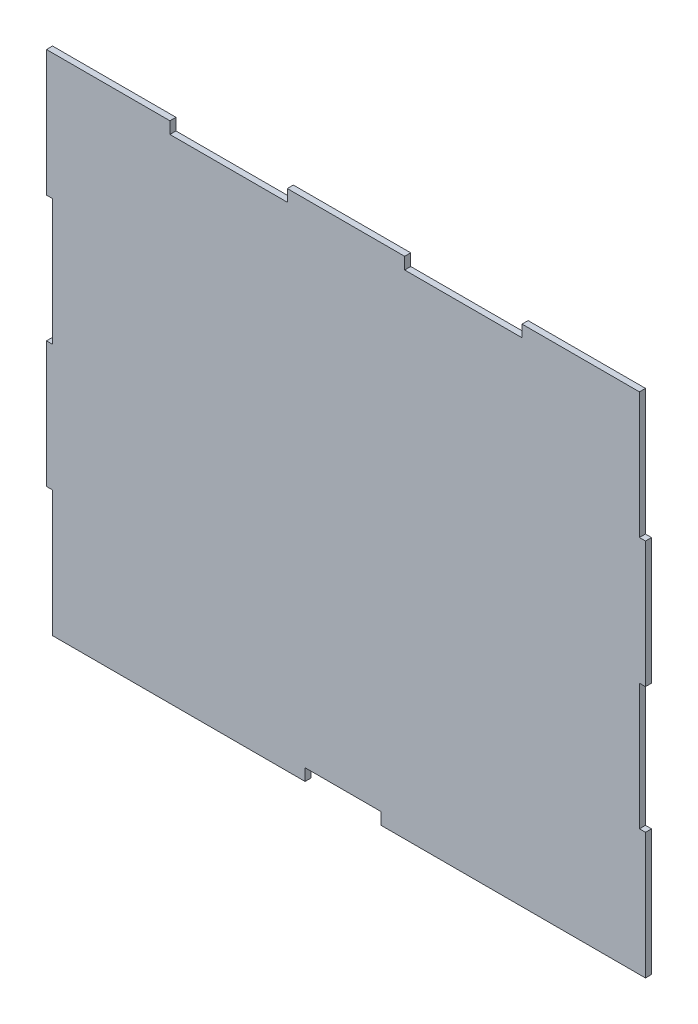
ISO-10303-21;
HEADER;
FILE_DESCRIPTION(('STEP AP214'),'2;1');
FILE_NAME('part.step','',(''),(''),'','','');
FILE_SCHEMA(('AUTOMOTIVE_DESIGN { 1 0 10303 214 1 1 1 1 }'));
ENDSEC;
DATA;
#1=APPLICATION_CONTEXT('core data for automotive mechanical design processes');
#2=APPLICATION_PROTOCOL_DEFINITION('international standard','automotive_design',2000,#1);
#3=PRODUCT_CONTEXT('',#1,'mechanical');
#4=PRODUCT('Part','Part','',(#3));
#5=PRODUCT_RELATED_PRODUCT_CATEGORY('part','',(#4));
#6=PRODUCT_DEFINITION_FORMATION('','',#4);
#7=PRODUCT_DEFINITION_CONTEXT('part definition',#1,'design');
#8=PRODUCT_DEFINITION('design','',#6,#7);
#9=PRODUCT_DEFINITION_SHAPE('','',#8);
#10=(LENGTH_UNIT() NAMED_UNIT(*) SI_UNIT(.MILLI.,.METRE.));
#11=(NAMED_UNIT(*) PLANE_ANGLE_UNIT() SI_UNIT($,.RADIAN.));
#12=(NAMED_UNIT(*) SI_UNIT($,.STERADIAN.) SOLID_ANGLE_UNIT());
#13=UNCERTAINTY_MEASURE_WITH_UNIT(LENGTH_MEASURE(1.E-05),#10,'distance_accuracy_value','');
#14=(GEOMETRIC_REPRESENTATION_CONTEXT(3) GLOBAL_UNCERTAINTY_ASSIGNED_CONTEXT((#13)) GLOBAL_UNIT_ASSIGNED_CONTEXT((#10,
#11,#12)) REPRESENTATION_CONTEXT('',''));
#15=CARTESIAN_POINT('',(0.,0.,0.));
#16=DIRECTION('',(0.,0.,1.));
#17=DIRECTION('',(1.,0.,0.));
#18=AXIS2_PLACEMENT_3D('',#15,#16,#17);
#19=CARTESIAN_POINT('',(59.0804000000001,253.981711341585,3.048));
#20=DIRECTION('',(-1.,0.,0.));
#21=DIRECTION('',(0.,0.,1.));
#22=AXIS2_PLACEMENT_3D('',#19,#20,#21);
#23=PLANE('',#22);
#24=DIRECTION('',(0.,1.,0.));
#25=VECTOR('',#24,1.);
#26=CARTESIAN_POINT('',(59.0804000000001,253.981711341585,0.));
#27=LINE('',#26,#25);
#28=CARTESIAN_POINT('',(59.0804000000001,248.012711341585,0.));
#29=VERTEX_POINT('',#28);
#30=CARTESIAN_POINT('',(59.0804000000001,253.981711341585,0.));
#31=VERTEX_POINT('',#30);
#32=EDGE_CURVE('E248',#29,#31,#27,.T.);
#33=ORIENTED_EDGE('',*,*,#32,.T.);
#34=DIRECTION('',(0.,0.,-1.));
#35=VECTOR('',#34,1.);
#36=CARTESIAN_POINT('',(59.0804000000001,253.981711341585,3.048));
#37=LINE('',#36,#35);
#38=CARTESIAN_POINT('',(59.0804000000001,253.981711341585,3.048));
#39=VERTEX_POINT('',#38);
#40=EDGE_CURVE('E11',#39,#31,#37,.T.);
#41=ORIENTED_EDGE('',*,*,#40,.F.);
#42=DIRECTION('',(0.,1.,0.));
#43=VECTOR('',#42,1.);
#44=CARTESIAN_POINT('',(59.0804000000001,253.981711341585,3.048));
#45=LINE('',#44,#43);
#46=CARTESIAN_POINT('',(59.0804000000001,248.012711341585,3.048));
#47=VERTEX_POINT('',#46);
#48=EDGE_CURVE('E302',#47,#39,#45,.T.);
#49=ORIENTED_EDGE('',*,*,#48,.F.);
#50=DIRECTION('',(0.,0.,-1.));
#51=VECTOR('',#50,1.);
#52=CARTESIAN_POINT('',(59.0804000000001,248.012711341585,3.048));
#53=LINE('',#52,#51);
#54=EDGE_CURVE('E244',#47,#29,#53,.T.);
#55=ORIENTED_EDGE('',*,*,#54,.T.);
#56=EDGE_LOOP('',(#33,#41,#49,#55));
#57=FACE_BOUND('',#56,.T.);
#58=ADVANCED_FACE('F32',(#57),#23,.F.);
#59=CARTESIAN_POINT('',(-3.048,253.981711341585,3.048));
#60=DIRECTION('',(0.,-1.,0.));
#61=DIRECTION('',(0.,0.,-1.));
#62=AXIS2_PLACEMENT_3D('',#59,#60,#61);
#63=PLANE('',#62);
#64=DIRECTION('',(-1.,0.,0.));
#65=VECTOR('',#64,1.);
#66=CARTESIAN_POINT('',(-3.048,253.981711341585,0.));
#67=LINE('',#66,#65);
#68=CARTESIAN_POINT('',(-3.048,253.981711341585,0.));
#69=VERTEX_POINT('',#68);
#70=EDGE_CURVE('E251',#31,#69,#67,.T.);
#71=ORIENTED_EDGE('',*,*,#70,.T.);
#72=DIRECTION('',(0.,0.,-1.));
#73=VECTOR('',#72,1.);
#74=CARTESIAN_POINT('',(-3.048,253.981711341585,3.048));
#75=LINE('',#74,#73);
#76=CARTESIAN_POINT('',(-3.048,253.981711341585,3.048));
#77=VERTEX_POINT('',#76);
#78=EDGE_CURVE('E40',#77,#69,#75,.T.);
#79=ORIENTED_EDGE('',*,*,#78,.F.);
#80=DIRECTION('',(-1.,0.,0.));
#81=VECTOR('',#80,1.);
#82=CARTESIAN_POINT('',(-3.048,253.981711341585,3.048));
#83=LINE('',#82,#81);
#84=EDGE_CURVE('E151',#39,#77,#83,.T.);
#85=ORIENTED_EDGE('',*,*,#84,.F.);
#86=ORIENTED_EDGE('',*,*,#40,.T.);
#87=EDGE_LOOP('',(#71,#79,#85,#86));
#88=FACE_BOUND('',#87,.T.);
#89=ADVANCED_FACE('F460',(#88),#63,.F.);
#90=CARTESIAN_POINT('',(-3.048,190.5,3.048));
#91=DIRECTION('',(1.,0.,0.));
#92=DIRECTION('',(0.,0.,-1.));
#93=AXIS2_PLACEMENT_3D('',#90,#91,#92);
#94=PLANE('',#93);
#95=DIRECTION('',(0.,-1.,0.));
#96=VECTOR('',#95,1.);
#97=CARTESIAN_POINT('',(-3.048,190.5,0.));
#98=LINE('',#97,#96);
#99=CARTESIAN_POINT('',(-3.048,190.5,0.));
#100=VERTEX_POINT('',#99);
#101=EDGE_CURVE('E253',#69,#100,#98,.T.);
#102=ORIENTED_EDGE('',*,*,#101,.T.);
#103=DIRECTION('',(0.,0.,-1.));
#104=VECTOR('',#103,1.);
#105=CARTESIAN_POINT('',(-3.048,190.5,3.048));
#106=LINE('',#105,#104);
#107=CARTESIAN_POINT('',(-3.048,190.5,3.048));
#108=VERTEX_POINT('',#107);
#109=EDGE_CURVE('E369',#108,#100,#106,.T.);
#110=ORIENTED_EDGE('',*,*,#109,.F.);
#111=DIRECTION('',(0.,-1.,0.));
#112=VECTOR('',#111,1.);
#113=CARTESIAN_POINT('',(-3.048,190.5,3.048));
#114=LINE('',#113,#112);
#115=EDGE_CURVE('E377',#77,#108,#114,.T.);
#116=ORIENTED_EDGE('',*,*,#115,.F.);
#117=ORIENTED_EDGE('',*,*,#78,.T.);
#118=EDGE_LOOP('',(#102,#110,#116,#117));
#119=FACE_BOUND('',#118,.T.);
#120=ADVANCED_FACE('F375',(#119),#94,.F.);
#121=CARTESIAN_POINT('',(0.,190.5,3.048));
#122=DIRECTION('',(0.,1.,0.));
#123=DIRECTION('',(0.,0.,1.));
#124=AXIS2_PLACEMENT_3D('',#121,#122,#123);
#125=PLANE('',#124);
#126=DIRECTION('',(1.,0.,0.));
#127=VECTOR('',#126,1.);
#128=CARTESIAN_POINT('',(0.,190.5,0.));
#129=LINE('',#128,#127);
#130=CARTESIAN_POINT('',(0.,190.5,0.));
#131=VERTEX_POINT('',#130);
#132=EDGE_CURVE('E255',#100,#131,#129,.T.);
#133=ORIENTED_EDGE('',*,*,#132,.T.);
#134=DIRECTION('',(0.,0.,-1.));
#135=VECTOR('',#134,1.);
#136=CARTESIAN_POINT('',(0.,190.5,3.048));
#137=LINE('',#136,#135);
#138=CARTESIAN_POINT('',(0.,190.5,3.048));
#139=VERTEX_POINT('',#138);
#140=EDGE_CURVE('E366',#139,#131,#137,.T.);
#141=ORIENTED_EDGE('',*,*,#140,.F.);
#142=DIRECTION('',(1.,0.,0.));
#143=VECTOR('',#142,1.);
#144=CARTESIAN_POINT('',(0.,190.5,3.048));
#145=LINE('',#144,#143);
#146=EDGE_CURVE('E395',#108,#139,#145,.T.);
#147=ORIENTED_EDGE('',*,*,#146,.F.);
#148=ORIENTED_EDGE('',*,*,#109,.T.);
#149=EDGE_LOOP('',(#133,#141,#147,#148));
#150=FACE_BOUND('',#149,.T.);
#151=ADVANCED_FACE('F386',(#150),#125,.F.);
#152=CARTESIAN_POINT('',(0.,127.,3.048));
#153=DIRECTION('',(1.,0.,0.));
#154=DIRECTION('',(0.,0.,-1.));
#155=AXIS2_PLACEMENT_3D('',#152,#153,#154);
#156=PLANE('',#155);
#157=DIRECTION('',(0.,-1.,0.));
#158=VECTOR('',#157,1.);
#159=CARTESIAN_POINT('',(0.,127.,0.));
#160=LINE('',#159,#158);
#161=CARTESIAN_POINT('',(0.,127.,0.));
#162=VERTEX_POINT('',#161);
#163=EDGE_CURVE('E257',#131,#162,#160,.T.);
#164=ORIENTED_EDGE('',*,*,#163,.T.);
#165=DIRECTION('',(0.,0.,-1.));
#166=VECTOR('',#165,1.);
#167=CARTESIAN_POINT('',(0.,127.,3.048));
#168=LINE('',#167,#166);
#169=CARTESIAN_POINT('',(0.,127.,3.048));
#170=VERTEX_POINT('',#169);
#171=EDGE_CURVE('E363',#170,#162,#168,.T.);
#172=ORIENTED_EDGE('',*,*,#171,.F.);
#173=DIRECTION('',(0.,-1.,0.));
#174=VECTOR('',#173,1.);
#175=CARTESIAN_POINT('',(0.,127.,3.048));
#176=LINE('',#175,#174);
#177=EDGE_CURVE('E392',#139,#170,#176,.T.);
#178=ORIENTED_EDGE('',*,*,#177,.F.);
#179=ORIENTED_EDGE('',*,*,#140,.T.);
#180=EDGE_LOOP('',(#164,#172,#178,#179));
#181=FACE_BOUND('',#180,.T.);
#182=ADVANCED_FACE('F390',(#181),#156,.F.);
#183=CARTESIAN_POINT('',(0.,127.,3.048));
#184=DIRECTION('',(0.,-1.,0.));
#185=DIRECTION('',(0.,0.,-1.));
#186=AXIS2_PLACEMENT_3D('',#183,#184,#185);
#187=PLANE('',#186);
#188=DIRECTION('',(-1.,0.,0.));
#189=VECTOR('',#188,1.);
#190=CARTESIAN_POINT('',(0.,127.,0.));
#191=LINE('',#190,#189);
#192=CARTESIAN_POINT('',(-3.048,127.,0.));
#193=VERTEX_POINT('',#192);
#194=EDGE_CURVE('E259',#162,#193,#191,.T.);
#195=ORIENTED_EDGE('',*,*,#194,.T.);
#196=DIRECTION('',(0.,0.,-1.));
#197=VECTOR('',#196,1.);
#198=CARTESIAN_POINT('',(-3.048,127.,3.048));
#199=LINE('',#198,#197);
#200=CARTESIAN_POINT('',(-3.048,127.,3.048));
#201=VERTEX_POINT('',#200);
#202=EDGE_CURVE('E360',#201,#193,#199,.T.);
#203=ORIENTED_EDGE('',*,*,#202,.F.);
#204=DIRECTION('',(-1.,0.,0.));
#205=VECTOR('',#204,1.);
#206=CARTESIAN_POINT('',(0.,127.,3.048));
#207=LINE('',#206,#205);
#208=EDGE_CURVE('E394',#170,#201,#207,.T.);
#209=ORIENTED_EDGE('',*,*,#208,.F.);
#210=ORIENTED_EDGE('',*,*,#171,.T.);
#211=EDGE_LOOP('',(#195,#203,#209,#210));
#212=FACE_BOUND('',#211,.T.);
#213=ADVANCED_FACE('F473',(#212),#187,.F.);
#214=CARTESIAN_POINT('',(-3.048,63.5,3.048));
#215=DIRECTION('',(1.,0.,0.));
#216=DIRECTION('',(0.,0.,-1.));
#217=AXIS2_PLACEMENT_3D('',#214,#215,#216);
#218=PLANE('',#217);
#219=DIRECTION('',(0.,-1.,0.));
#220=VECTOR('',#219,1.);
#221=CARTESIAN_POINT('',(-3.048,63.5,0.));
#222=LINE('',#221,#220);
#223=CARTESIAN_POINT('',(-3.048,63.5,0.));
#224=VERTEX_POINT('',#223);
#225=EDGE_CURVE('E261',#193,#224,#222,.T.);
#226=ORIENTED_EDGE('',*,*,#225,.T.);
#227=DIRECTION('',(0.,0.,-1.));
#228=VECTOR('',#227,1.);
#229=CARTESIAN_POINT('',(-3.048,63.5,3.048));
#230=LINE('',#229,#228);
#231=CARTESIAN_POINT('',(-3.048,63.5,3.048));
#232=VERTEX_POINT('',#231);
#233=EDGE_CURVE('E357',#232,#224,#230,.T.);
#234=ORIENTED_EDGE('',*,*,#233,.F.);
#235=DIRECTION('',(0.,-1.,0.));
#236=VECTOR('',#235,1.);
#237=CARTESIAN_POINT('',(-3.048,63.5,3.048));
#238=LINE('',#237,#236);
#239=EDGE_CURVE('E397',#201,#232,#238,.T.);
#240=ORIENTED_EDGE('',*,*,#239,.F.);
#241=ORIENTED_EDGE('',*,*,#202,.T.);
#242=EDGE_LOOP('',(#226,#234,#240,#241));
#243=FACE_BOUND('',#242,.T.);
#244=ADVANCED_FACE('F476',(#243),#218,.F.);
#245=CARTESIAN_POINT('',(0.,63.5,3.048));
#246=DIRECTION('',(0.,1.,0.));
#247=DIRECTION('',(0.,0.,1.));
#248=AXIS2_PLACEMENT_3D('',#245,#246,#247);
#249=PLANE('',#248);
#250=DIRECTION('',(1.,0.,0.));
#251=VECTOR('',#250,1.);
#252=CARTESIAN_POINT('',(0.,63.5,0.));
#253=LINE('',#252,#251);
#254=CARTESIAN_POINT('',(0.,63.5,0.));
#255=VERTEX_POINT('',#254);
#256=EDGE_CURVE('E263',#224,#255,#253,.T.);
#257=ORIENTED_EDGE('',*,*,#256,.T.);
#258=DIRECTION('',(0.,0.,-1.));
#259=VECTOR('',#258,1.);
#260=CARTESIAN_POINT('',(0.,63.5,3.048));
#261=LINE('',#260,#259);
#262=CARTESIAN_POINT('',(0.,63.5,3.048));
#263=VERTEX_POINT('',#262);
#264=EDGE_CURVE('E354',#263,#255,#261,.T.);
#265=ORIENTED_EDGE('',*,*,#264,.F.);
#266=DIRECTION('',(1.,0.,0.));
#267=VECTOR('',#266,1.);
#268=CARTESIAN_POINT('',(0.,63.5,3.048));
#269=LINE('',#268,#267);
#270=EDGE_CURVE('E403',#232,#263,#269,.T.);
#271=ORIENTED_EDGE('',*,*,#270,.F.);
#272=ORIENTED_EDGE('',*,*,#233,.T.);
#273=EDGE_LOOP('',(#257,#265,#271,#272));
#274=FACE_BOUND('',#273,.T.);
#275=ADVANCED_FACE('F480',(#274),#249,.F.);
#276=CARTESIAN_POINT('',(0.,0.,3.048));
#277=DIRECTION('',(1.,0.,0.));
#278=DIRECTION('',(0.,0.,-1.));
#279=AXIS2_PLACEMENT_3D('',#276,#277,#278);
#280=PLANE('',#279);
#281=DIRECTION('',(0.,-1.,0.));
#282=VECTOR('',#281,1.);
#283=CARTESIAN_POINT('',(0.,0.,0.));
#284=LINE('',#283,#282);
#285=CARTESIAN_POINT('',(0.,0.,0.));
#286=VERTEX_POINT('',#285);
#287=EDGE_CURVE('E265',#255,#286,#284,.T.);
#288=ORIENTED_EDGE('',*,*,#287,.T.);
#289=DIRECTION('',(0.,0.,-1.));
#290=VECTOR('',#289,1.);
#291=CARTESIAN_POINT('',(0.,0.,3.048));
#292=LINE('',#291,#290);
#293=CARTESIAN_POINT('',(0.,0.,3.048));
#294=VERTEX_POINT('',#293);
#295=EDGE_CURVE('E351',#294,#286,#292,.T.);
#296=ORIENTED_EDGE('',*,*,#295,.F.);
#297=DIRECTION('',(0.,-1.,0.));
#298=VECTOR('',#297,1.);
#299=CARTESIAN_POINT('',(0.,0.,3.048));
#300=LINE('',#299,#298);
#301=EDGE_CURVE('E405',#263,#294,#300,.T.);
#302=ORIENTED_EDGE('',*,*,#301,.F.);
#303=ORIENTED_EDGE('',*,*,#264,.T.);
#304=EDGE_LOOP('',(#288,#296,#302,#303));
#305=FACE_BOUND('',#304,.T.);
#306=ADVANCED_FACE('F484',(#305),#280,.F.);
#307=CARTESIAN_POINT('',(0.,0.,3.048));
#308=DIRECTION('',(0.,1.,0.));
#309=DIRECTION('',(0.,0.,1.));
#310=AXIS2_PLACEMENT_3D('',#307,#308,#309);
#311=PLANE('',#310);
#312=DIRECTION('',(1.,0.,0.));
#313=VECTOR('',#312,1.);
#314=CARTESIAN_POINT('',(0.,0.,0.));
#315=LINE('',#314,#313);
#316=CARTESIAN_POINT('',(127.127,0.,0.));
#317=VERTEX_POINT('',#316);
#318=EDGE_CURVE('E267',#286,#317,#315,.T.);
#319=ORIENTED_EDGE('',*,*,#318,.T.);
#320=DIRECTION('',(0.,0.,-1.));
#321=VECTOR('',#320,1.);
#322=CARTESIAN_POINT('',(127.127,0.,3.048));
#323=LINE('',#322,#321);
#324=CARTESIAN_POINT('',(127.127,0.,3.048));
#325=VERTEX_POINT('',#324);
#326=EDGE_CURVE('E348',#325,#317,#323,.T.);
#327=ORIENTED_EDGE('',*,*,#326,.F.);
#328=DIRECTION('',(1.,0.,0.));
#329=VECTOR('',#328,1.);
#330=CARTESIAN_POINT('',(0.,0.,3.048));
#331=LINE('',#330,#329);
#332=EDGE_CURVE('E407',#294,#325,#331,.T.);
#333=ORIENTED_EDGE('',*,*,#332,.F.);
#334=ORIENTED_EDGE('',*,*,#295,.T.);
#335=EDGE_LOOP('',(#319,#327,#333,#334));
#336=FACE_BOUND('',#335,.T.);
#337=ADVANCED_FACE('F488',(#336),#311,.F.);
#338=CARTESIAN_POINT('',(127.127,0.,3.048));
#339=DIRECTION('',(-1.,0.,0.));
#340=DIRECTION('',(0.,0.,1.));
#341=AXIS2_PLACEMENT_3D('',#338,#339,#340);
#342=PLANE('',#341);
#343=DIRECTION('',(0.,1.,0.));
#344=VECTOR('',#343,1.);
#345=CARTESIAN_POINT('',(127.127,0.,0.));
#346=LINE('',#345,#344);
#347=CARTESIAN_POINT('',(127.127,5.99439999999999,0.));
#348=VERTEX_POINT('',#347);
#349=EDGE_CURVE('E269',#317,#348,#346,.T.);
#350=ORIENTED_EDGE('',*,*,#349,.T.);
#351=DIRECTION('',(0.,0.,-1.));
#352=VECTOR('',#351,1.);
#353=CARTESIAN_POINT('',(127.127,5.99439999999999,3.048));
#354=LINE('',#353,#352);
#355=CARTESIAN_POINT('',(127.127,5.99439999999999,3.048));
#356=VERTEX_POINT('',#355);
#357=EDGE_CURVE('E345',#356,#348,#354,.T.);
#358=ORIENTED_EDGE('',*,*,#357,.F.);
#359=DIRECTION('',(0.,1.,0.));
#360=VECTOR('',#359,1.);
#361=CARTESIAN_POINT('',(127.127,0.,3.048));
#362=LINE('',#361,#360);
#363=EDGE_CURVE('E409',#325,#356,#362,.T.);
#364=ORIENTED_EDGE('',*,*,#363,.F.);
#365=ORIENTED_EDGE('',*,*,#326,.T.);
#366=EDGE_LOOP('',(#350,#358,#364,#365));
#367=FACE_BOUND('',#366,.T.);
#368=ADVANCED_FACE('F492',(#367),#342,.F.);
#369=CARTESIAN_POINT('',(127.127,5.99439999999999,3.048));
#370=DIRECTION('',(0.,1.,0.));
#371=DIRECTION('',(0.,0.,1.));
#372=AXIS2_PLACEMENT_3D('',#369,#370,#371);
#373=PLANE('',#372);
#374=DIRECTION('',(1.,0.,0.));
#375=VECTOR('',#374,1.);
#376=CARTESIAN_POINT('',(127.127,5.99439999999999,0.));
#377=LINE('',#376,#375);
#378=CARTESIAN_POINT('',(165.227,5.99439999999999,0.));
#379=VERTEX_POINT('',#378);
#380=EDGE_CURVE('E271',#348,#379,#377,.T.);
#381=ORIENTED_EDGE('',*,*,#380,.T.);
#382=DIRECTION('',(0.,0.,-1.));
#383=VECTOR('',#382,1.);
#384=CARTESIAN_POINT('',(165.227,5.99439999999999,3.048));
#385=LINE('',#384,#383);
#386=CARTESIAN_POINT('',(165.227,5.99439999999999,3.048));
#387=VERTEX_POINT('',#386);
#388=EDGE_CURVE('E342',#387,#379,#385,.T.);
#389=ORIENTED_EDGE('',*,*,#388,.F.);
#390=DIRECTION('',(1.,0.,0.));
#391=VECTOR('',#390,1.);
#392=CARTESIAN_POINT('',(127.127,5.99439999999999,3.048));
#393=LINE('',#392,#391);
#394=EDGE_CURVE('E411',#356,#387,#393,.T.);
#395=ORIENTED_EDGE('',*,*,#394,.F.);
#396=ORIENTED_EDGE('',*,*,#357,.T.);
#397=EDGE_LOOP('',(#381,#389,#395,#396));
#398=FACE_BOUND('',#397,.T.);
#399=ADVANCED_FACE('F496',(#398),#373,.F.);
#400=CARTESIAN_POINT('',(165.227,5.99439999999999,3.048));
#401=DIRECTION('',(1.,0.,0.));
#402=DIRECTION('',(0.,0.,-1.));
#403=AXIS2_PLACEMENT_3D('',#400,#401,#402);
#404=PLANE('',#403);
#405=DIRECTION('',(0.,-1.,0.));
#406=VECTOR('',#405,1.);
#407=CARTESIAN_POINT('',(165.227,5.99439999999999,0.));
#408=LINE('',#407,#406);
#409=CARTESIAN_POINT('',(165.227,0.,0.));
#410=VERTEX_POINT('',#409);
#411=EDGE_CURVE('E273',#379,#410,#408,.T.);
#412=ORIENTED_EDGE('',*,*,#411,.T.);
#413=DIRECTION('',(0.,0.,-1.));
#414=VECTOR('',#413,1.);
#415=CARTESIAN_POINT('',(165.227,0.,3.048));
#416=LINE('',#415,#414);
#417=CARTESIAN_POINT('',(165.227,0.,3.048));
#418=VERTEX_POINT('',#417);
#419=EDGE_CURVE('E339',#418,#410,#416,.T.);
#420=ORIENTED_EDGE('',*,*,#419,.F.);
#421=DIRECTION('',(0.,-1.,0.));
#422=VECTOR('',#421,1.);
#423=CARTESIAN_POINT('',(165.227,5.99439999999999,3.048));
#424=LINE('',#423,#422);
#425=EDGE_CURVE('E413',#387,#418,#424,.T.);
#426=ORIENTED_EDGE('',*,*,#425,.F.);
#427=ORIENTED_EDGE('',*,*,#388,.T.);
#428=EDGE_LOOP('',(#412,#420,#426,#427));
#429=FACE_BOUND('',#428,.T.);
#430=ADVANCED_FACE('F500',(#429),#404,.F.);
#431=CARTESIAN_POINT('',(165.227,0.,3.048));
#432=DIRECTION('',(0.,1.,0.));
#433=DIRECTION('',(0.,0.,1.));
#434=AXIS2_PLACEMENT_3D('',#431,#432,#433);
#435=PLANE('',#434);
#436=DIRECTION('',(1.,0.,0.));
#437=VECTOR('',#436,1.);
#438=CARTESIAN_POINT('',(165.227,0.,0.));
#439=LINE('',#438,#437);
#440=CARTESIAN_POINT('',(298.45,0.,0.));
#441=VERTEX_POINT('',#440);
#442=EDGE_CURVE('E275',#410,#441,#439,.T.);
#443=ORIENTED_EDGE('',*,*,#442,.T.);
#444=DIRECTION('',(0.,0.,-1.));
#445=VECTOR('',#444,1.);
#446=CARTESIAN_POINT('',(298.45,0.,3.048));
#447=LINE('',#446,#445);
#448=CARTESIAN_POINT('',(298.45,0.,3.048));
#449=VERTEX_POINT('',#448);
#450=EDGE_CURVE('E336',#449,#441,#447,.T.);
#451=ORIENTED_EDGE('',*,*,#450,.F.);
#452=DIRECTION('',(1.,0.,0.));
#453=VECTOR('',#452,1.);
#454=CARTESIAN_POINT('',(165.227,0.,3.048));
#455=LINE('',#454,#453);
#456=EDGE_CURVE('E415',#418,#449,#455,.T.);
#457=ORIENTED_EDGE('',*,*,#456,.F.);
#458=ORIENTED_EDGE('',*,*,#419,.T.);
#459=EDGE_LOOP('',(#443,#451,#457,#458));
#460=FACE_BOUND('',#459,.T.);
#461=ADVANCED_FACE('F504',(#460),#435,.F.);
#462=CARTESIAN_POINT('',(298.45,0.,3.048));
#463=DIRECTION('',(-1.,0.,0.));
#464=DIRECTION('',(0.,0.,1.));
#465=AXIS2_PLACEMENT_3D('',#462,#463,#464);
#466=PLANE('',#465);
#467=DIRECTION('',(0.,1.,0.));
#468=VECTOR('',#467,1.);
#469=CARTESIAN_POINT('',(298.45,0.,0.));
#470=LINE('',#469,#468);
#471=CARTESIAN_POINT('',(298.45,63.5,0.));
#472=VERTEX_POINT('',#471);
#473=EDGE_CURVE('E277',#441,#472,#470,.T.);
#474=ORIENTED_EDGE('',*,*,#473,.T.);
#475=DIRECTION('',(0.,0.,-1.));
#476=VECTOR('',#475,1.);
#477=CARTESIAN_POINT('',(298.45,63.5,3.048));
#478=LINE('',#477,#476);
#479=CARTESIAN_POINT('',(298.45,63.5,3.048));
#480=VERTEX_POINT('',#479);
#481=EDGE_CURVE('E333',#480,#472,#478,.T.);
#482=ORIENTED_EDGE('',*,*,#481,.F.);
#483=DIRECTION('',(0.,1.,0.));
#484=VECTOR('',#483,1.);
#485=CARTESIAN_POINT('',(298.45,0.,3.048));
#486=LINE('',#485,#484);
#487=EDGE_CURVE('E417',#449,#480,#486,.T.);
#488=ORIENTED_EDGE('',*,*,#487,.F.);
#489=ORIENTED_EDGE('',*,*,#450,.T.);
#490=EDGE_LOOP('',(#474,#482,#488,#489));
#491=FACE_BOUND('',#490,.T.);
#492=ADVANCED_FACE('F508',(#491),#466,.F.);
#493=CARTESIAN_POINT('',(298.45,63.5,3.048));
#494=DIRECTION('',(0.,-1.,0.));
#495=DIRECTION('',(0.,0.,-1.));
#496=AXIS2_PLACEMENT_3D('',#493,#494,#495);
#497=PLANE('',#496);
#498=DIRECTION('',(-1.,0.,0.));
#499=VECTOR('',#498,1.);
#500=CARTESIAN_POINT('',(298.45,63.5,0.));
#501=LINE('',#500,#499);
#502=CARTESIAN_POINT('',(295.402,63.5,0.));
#503=VERTEX_POINT('',#502);
#504=EDGE_CURVE('E279',#472,#503,#501,.T.);
#505=ORIENTED_EDGE('',*,*,#504,.T.);
#506=DIRECTION('',(0.,0.,-1.));
#507=VECTOR('',#506,1.);
#508=CARTESIAN_POINT('',(295.402,63.5,3.048));
#509=LINE('',#508,#507);
#510=CARTESIAN_POINT('',(295.402,63.5,3.048));
#511=VERTEX_POINT('',#510);
#512=EDGE_CURVE('E330',#511,#503,#509,.T.);
#513=ORIENTED_EDGE('',*,*,#512,.F.);
#514=DIRECTION('',(-1.,0.,0.));
#515=VECTOR('',#514,1.);
#516=CARTESIAN_POINT('',(298.45,63.5,3.048));
#517=LINE('',#516,#515);
#518=EDGE_CURVE('E419',#480,#511,#517,.T.);
#519=ORIENTED_EDGE('',*,*,#518,.F.);
#520=ORIENTED_EDGE('',*,*,#481,.T.);
#521=EDGE_LOOP('',(#505,#513,#519,#520));
#522=FACE_BOUND('',#521,.T.);
#523=ADVANCED_FACE('F512',(#522),#497,.F.);
#524=CARTESIAN_POINT('',(295.402,63.5,3.048));
#525=DIRECTION('',(-1.,0.,0.));
#526=DIRECTION('',(0.,0.,1.));
#527=AXIS2_PLACEMENT_3D('',#524,#525,#526);
#528=PLANE('',#527);
#529=DIRECTION('',(0.,1.,0.));
#530=VECTOR('',#529,1.);
#531=CARTESIAN_POINT('',(295.402,63.5,0.));
#532=LINE('',#531,#530);
#533=CARTESIAN_POINT('',(295.402,126.981711341585,0.));
#534=VERTEX_POINT('',#533);
#535=EDGE_CURVE('E281',#503,#534,#532,.T.);
#536=ORIENTED_EDGE('',*,*,#535,.T.);
#537=DIRECTION('',(0.,0.,-1.));
#538=VECTOR('',#537,1.);
#539=CARTESIAN_POINT('',(295.402,126.981711341585,3.048));
#540=LINE('',#539,#538);
#541=CARTESIAN_POINT('',(295.402,126.981711341585,3.048));
#542=VERTEX_POINT('',#541);
#543=EDGE_CURVE('E327',#542,#534,#540,.T.);
#544=ORIENTED_EDGE('',*,*,#543,.F.);
#545=DIRECTION('',(0.,1.,0.));
#546=VECTOR('',#545,1.);
#547=CARTESIAN_POINT('',(295.402,63.5,3.048));
#548=LINE('',#547,#546);
#549=EDGE_CURVE('E421',#511,#542,#548,.T.);
#550=ORIENTED_EDGE('',*,*,#549,.F.);
#551=ORIENTED_EDGE('',*,*,#512,.T.);
#552=EDGE_LOOP('',(#536,#544,#550,#551));
#553=FACE_BOUND('',#552,.T.);
#554=ADVANCED_FACE('F516',(#553),#528,.F.);
#555=CARTESIAN_POINT('',(295.402,126.981711341585,3.048));
#556=DIRECTION('',(0.,1.,0.));
#557=DIRECTION('',(0.,0.,1.));
#558=AXIS2_PLACEMENT_3D('',#555,#556,#557);
#559=PLANE('',#558);
#560=DIRECTION('',(1.,0.,0.));
#561=VECTOR('',#560,1.);
#562=CARTESIAN_POINT('',(295.402,126.981711341585,0.));
#563=LINE('',#562,#561);
#564=CARTESIAN_POINT('',(298.45,126.981711341585,0.));
#565=VERTEX_POINT('',#564);
#566=EDGE_CURVE('E283',#534,#565,#563,.T.);
#567=ORIENTED_EDGE('',*,*,#566,.T.);
#568=DIRECTION('',(0.,0.,-1.));
#569=VECTOR('',#568,1.);
#570=CARTESIAN_POINT('',(298.45,126.981711341585,3.048));
#571=LINE('',#570,#569);
#572=CARTESIAN_POINT('',(298.45,126.981711341585,3.048));
#573=VERTEX_POINT('',#572);
#574=EDGE_CURVE('E324',#573,#565,#571,.T.);
#575=ORIENTED_EDGE('',*,*,#574,.F.);
#576=DIRECTION('',(1.,0.,0.));
#577=VECTOR('',#576,1.);
#578=CARTESIAN_POINT('',(295.402,126.981711341585,3.048));
#579=LINE('',#578,#577);
#580=EDGE_CURVE('E423',#542,#573,#579,.T.);
#581=ORIENTED_EDGE('',*,*,#580,.F.);
#582=ORIENTED_EDGE('',*,*,#543,.T.);
#583=EDGE_LOOP('',(#567,#575,#581,#582));
#584=FACE_BOUND('',#583,.T.);
#585=ADVANCED_FACE('F520',(#584),#559,.F.);
#586=CARTESIAN_POINT('',(298.45,126.981711341585,3.048));
#587=DIRECTION('',(-1.,0.,0.));
#588=DIRECTION('',(0.,-1.,0.));
#589=AXIS2_PLACEMENT_3D('',#586,#587,#588);
#590=PLANE('',#589);
#591=DIRECTION('',(0.,1.,0.));
#592=VECTOR('',#591,1.);
#593=CARTESIAN_POINT('',(298.45,126.981711341585,0.));
#594=LINE('',#593,#592);
#595=CARTESIAN_POINT('',(298.45,190.481711341585,0.));
#596=VERTEX_POINT('',#595);
#597=EDGE_CURVE('E285',#565,#596,#594,.T.);
#598=ORIENTED_EDGE('',*,*,#597,.T.);
#599=DIRECTION('',(0.,0.,-1.));
#600=VECTOR('',#599,1.);
#601=CARTESIAN_POINT('',(298.45,190.481711341585,3.048));
#602=LINE('',#601,#600);
#603=CARTESIAN_POINT('',(298.45,190.481711341585,3.048));
#604=VERTEX_POINT('',#603);
#605=EDGE_CURVE('E321',#604,#596,#602,.T.);
#606=ORIENTED_EDGE('',*,*,#605,.F.);
#607=DIRECTION('',(0.,1.,0.));
#608=VECTOR('',#607,1.);
#609=CARTESIAN_POINT('',(298.45,126.981711341585,3.048));
#610=LINE('',#609,#608);
#611=EDGE_CURVE('E425',#573,#604,#610,.T.);
#612=ORIENTED_EDGE('',*,*,#611,.F.);
#613=ORIENTED_EDGE('',*,*,#574,.T.);
#614=EDGE_LOOP('',(#598,#606,#612,#613));
#615=FACE_BOUND('',#614,.T.);
#616=ADVANCED_FACE('F524',(#615),#590,.F.);
#617=CARTESIAN_POINT('',(298.45,190.481711341585,3.048));
#618=DIRECTION('',(0.,-1.,0.));
#619=DIRECTION('',(0.,0.,-1.));
#620=AXIS2_PLACEMENT_3D('',#617,#618,#619);
#621=PLANE('',#620);
#622=DIRECTION('',(-1.,0.,0.));
#623=VECTOR('',#622,1.);
#624=CARTESIAN_POINT('',(298.45,190.481711341585,0.));
#625=LINE('',#624,#623);
#626=CARTESIAN_POINT('',(295.402,190.481711341585,0.));
#627=VERTEX_POINT('',#626);
#628=EDGE_CURVE('E287',#596,#627,#625,.T.);
#629=ORIENTED_EDGE('',*,*,#628,.T.);
#630=DIRECTION('',(0.,0.,-1.));
#631=VECTOR('',#630,1.);
#632=CARTESIAN_POINT('',(295.402,190.481711341585,3.048));
#633=LINE('',#632,#631);
#634=CARTESIAN_POINT('',(295.402,190.481711341585,3.048));
#635=VERTEX_POINT('',#634);
#636=EDGE_CURVE('E318',#635,#627,#633,.T.);
#637=ORIENTED_EDGE('',*,*,#636,.F.);
#638=DIRECTION('',(-1.,0.,0.));
#639=VECTOR('',#638,1.);
#640=CARTESIAN_POINT('',(298.45,190.481711341585,3.048));
#641=LINE('',#640,#639);
#642=EDGE_CURVE('E427',#604,#635,#641,.T.);
#643=ORIENTED_EDGE('',*,*,#642,.F.);
#644=ORIENTED_EDGE('',*,*,#605,.T.);
#645=EDGE_LOOP('',(#629,#637,#643,#644));
#646=FACE_BOUND('',#645,.T.);
#647=ADVANCED_FACE('F528',(#646),#621,.F.);
#648=CARTESIAN_POINT('',(295.402,190.481711341585,3.048));
#649=DIRECTION('',(-1.,0.,0.));
#650=DIRECTION('',(0.,-1.,0.));
#651=AXIS2_PLACEMENT_3D('',#648,#649,#650);
#652=PLANE('',#651);
#653=DIRECTION('',(0.,1.,0.));
#654=VECTOR('',#653,1.);
#655=CARTESIAN_POINT('',(295.402,190.481711341585,0.));
#656=LINE('',#655,#654);
#657=CARTESIAN_POINT('',(295.402,253.981711341585,0.));
#658=VERTEX_POINT('',#657);
#659=EDGE_CURVE('E289',#627,#658,#656,.T.);
#660=ORIENTED_EDGE('',*,*,#659,.T.);
#661=DIRECTION('',(0.,0.,-1.));
#662=VECTOR('',#661,1.);
#663=CARTESIAN_POINT('',(295.402,253.981711341585,3.048));
#664=LINE('',#663,#662);
#665=CARTESIAN_POINT('',(295.402,253.981711341585,3.048));
#666=VERTEX_POINT('',#665);
#667=EDGE_CURVE('E315',#666,#658,#664,.T.);
#668=ORIENTED_EDGE('',*,*,#667,.F.);
#669=DIRECTION('',(0.,1.,0.));
#670=VECTOR('',#669,1.);
#671=CARTESIAN_POINT('',(295.402,190.481711341585,3.048));
#672=LINE('',#671,#670);
#673=EDGE_CURVE('E429',#635,#666,#672,.T.);
#674=ORIENTED_EDGE('',*,*,#673,.F.);
#675=ORIENTED_EDGE('',*,*,#636,.T.);
#676=EDGE_LOOP('',(#660,#668,#674,#675));
#677=FACE_BOUND('',#676,.T.);
#678=ADVANCED_FACE('F532',(#677),#652,.F.);
#679=CARTESIAN_POINT('',(236.3216,253.981711341585,3.048));
#680=DIRECTION('',(0.,-1.,0.));
#681=DIRECTION('',(0.,0.,-1.));
#682=AXIS2_PLACEMENT_3D('',#679,#680,#681);
#683=PLANE('',#682);
#684=DIRECTION('',(-1.,0.,0.));
#685=VECTOR('',#684,1.);
#686=CARTESIAN_POINT('',(236.3216,253.981711341585,0.));
#687=LINE('',#686,#685);
#688=CARTESIAN_POINT('',(236.3216,253.981711341585,0.));
#689=VERTEX_POINT('',#688);
#690=EDGE_CURVE('E291',#658,#689,#687,.T.);
#691=ORIENTED_EDGE('',*,*,#690,.T.);
#692=DIRECTION('',(0.,0.,-1.));
#693=VECTOR('',#692,1.);
#694=CARTESIAN_POINT('',(236.3216,253.981711341585,3.048));
#695=LINE('',#694,#693);
#696=CARTESIAN_POINT('',(236.3216,253.981711341585,3.048));
#697=VERTEX_POINT('',#696);
#698=EDGE_CURVE('E312',#697,#689,#695,.T.);
#699=ORIENTED_EDGE('',*,*,#698,.F.);
#700=DIRECTION('',(-1.,0.,0.));
#701=VECTOR('',#700,1.);
#702=CARTESIAN_POINT('',(236.3216,253.981711341585,3.048));
#703=LINE('',#702,#701);
#704=EDGE_CURVE('E431',#666,#697,#703,.T.);
#705=ORIENTED_EDGE('',*,*,#704,.F.);
#706=ORIENTED_EDGE('',*,*,#667,.T.);
#707=EDGE_LOOP('',(#691,#699,#705,#706));
#708=FACE_BOUND('',#707,.T.);
#709=ADVANCED_FACE('F536',(#708),#683,.F.);
#710=CARTESIAN_POINT('',(236.3216,248.012711341585,3.048));
#711=DIRECTION('',(1.,0.,0.));
#712=DIRECTION('',(0.,0.,-1.));
#713=AXIS2_PLACEMENT_3D('',#710,#711,#712);
#714=PLANE('',#713);
#715=DIRECTION('',(0.,-1.,0.));
#716=VECTOR('',#715,1.);
#717=CARTESIAN_POINT('',(236.3216,248.012711341585,0.));
#718=LINE('',#717,#716);
#719=CARTESIAN_POINT('',(236.3216,248.012711341585,0.));
#720=VERTEX_POINT('',#719);
#721=EDGE_CURVE('E293',#689,#720,#718,.T.);
#722=ORIENTED_EDGE('',*,*,#721,.T.);
#723=DIRECTION('',(0.,0.,-1.));
#724=VECTOR('',#723,1.);
#725=CARTESIAN_POINT('',(236.3216,248.012711341585,3.048));
#726=LINE('',#725,#724);
#727=CARTESIAN_POINT('',(236.3216,248.012711341585,3.048));
#728=VERTEX_POINT('',#727);
#729=EDGE_CURVE('E309',#728,#720,#726,.T.);
#730=ORIENTED_EDGE('',*,*,#729,.F.);
#731=DIRECTION('',(0.,-1.,0.));
#732=VECTOR('',#731,1.);
#733=CARTESIAN_POINT('',(236.3216,248.012711341585,3.048));
#734=LINE('',#733,#732);
#735=EDGE_CURVE('E433',#697,#728,#734,.T.);
#736=ORIENTED_EDGE('',*,*,#735,.F.);
#737=ORIENTED_EDGE('',*,*,#698,.T.);
#738=EDGE_LOOP('',(#722,#730,#736,#737));
#739=FACE_BOUND('',#738,.T.);
#740=ADVANCED_FACE('F540',(#739),#714,.F.);
#741=CARTESIAN_POINT('',(177.2412,248.012711341585,3.048));
#742=DIRECTION('',(0.,-1.,0.));
#743=DIRECTION('',(0.,0.,-1.));
#744=AXIS2_PLACEMENT_3D('',#741,#742,#743);
#745=PLANE('',#744);
#746=DIRECTION('',(-1.,0.,0.));
#747=VECTOR('',#746,1.);
#748=CARTESIAN_POINT('',(177.2412,248.012711341585,0.));
#749=LINE('',#748,#747);
#750=CARTESIAN_POINT('',(177.2412,248.012711341585,0.));
#751=VERTEX_POINT('',#750);
#752=EDGE_CURVE('E295',#720,#751,#749,.T.);
#753=ORIENTED_EDGE('',*,*,#752,.T.);
#754=DIRECTION('',(0.,0.,-1.));
#755=VECTOR('',#754,1.);
#756=CARTESIAN_POINT('',(177.2412,248.012711341585,3.048));
#757=LINE('',#756,#755);
#758=CARTESIAN_POINT('',(177.2412,248.012711341585,3.048));
#759=VERTEX_POINT('',#758);
#760=EDGE_CURVE('E306',#759,#751,#757,.T.);
#761=ORIENTED_EDGE('',*,*,#760,.F.);
#762=DIRECTION('',(-1.,0.,0.));
#763=VECTOR('',#762,1.);
#764=CARTESIAN_POINT('',(177.2412,248.012711341585,3.048));
#765=LINE('',#764,#763);
#766=EDGE_CURVE('E435',#728,#759,#765,.T.);
#767=ORIENTED_EDGE('',*,*,#766,.F.);
#768=ORIENTED_EDGE('',*,*,#729,.T.);
#769=EDGE_LOOP('',(#753,#761,#767,#768));
#770=FACE_BOUND('',#769,.T.);
#771=ADVANCED_FACE('F441',(#770),#745,.F.);
#772=CARTESIAN_POINT('',(177.2412,253.981711341585,3.048));
#773=DIRECTION('',(-1.,0.,0.));
#774=DIRECTION('',(0.,0.,1.));
#775=AXIS2_PLACEMENT_3D('',#772,#773,#774);
#776=PLANE('',#775);
#777=DIRECTION('',(0.,1.,0.));
#778=VECTOR('',#777,1.);
#779=CARTESIAN_POINT('',(177.2412,253.981711341585,0.));
#780=LINE('',#779,#778);
#781=CARTESIAN_POINT('',(177.2412,253.981711341585,0.));
#782=VERTEX_POINT('',#781);
#783=EDGE_CURVE('E297',#751,#782,#780,.T.);
#784=ORIENTED_EDGE('',*,*,#783,.T.);
#785=DIRECTION('',(0.,0.,-1.));
#786=VECTOR('',#785,1.);
#787=CARTESIAN_POINT('',(177.2412,253.981711341585,3.048));
#788=LINE('',#787,#786);
#789=CARTESIAN_POINT('',(177.2412,253.981711341585,3.048));
#790=VERTEX_POINT('',#789);
#791=EDGE_CURVE('E239',#790,#782,#788,.T.);
#792=ORIENTED_EDGE('',*,*,#791,.F.);
#793=DIRECTION('',(0.,1.,0.));
#794=VECTOR('',#793,1.);
#795=CARTESIAN_POINT('',(177.2412,253.981711341585,3.048));
#796=LINE('',#795,#794);
#797=EDGE_CURVE('E230',#759,#790,#796,.T.);
#798=ORIENTED_EDGE('',*,*,#797,.F.);
#799=ORIENTED_EDGE('',*,*,#760,.T.);
#800=EDGE_LOOP('',(#784,#792,#798,#799));
#801=FACE_BOUND('',#800,.T.);
#802=ADVANCED_FACE('F445',(#801),#776,.F.);
#803=CARTESIAN_POINT('',(118.1608,253.981711341585,3.048));
#804=DIRECTION('',(0.,-1.,0.));
#805=DIRECTION('',(0.,0.,-1.));
#806=AXIS2_PLACEMENT_3D('',#803,#804,#805);
#807=PLANE('',#806);
#808=DIRECTION('',(-1.,0.,0.));
#809=VECTOR('',#808,1.);
#810=CARTESIAN_POINT('',(118.1608,253.981711341585,0.));
#811=LINE('',#810,#809);
#812=CARTESIAN_POINT('',(118.1608,253.981711341585,0.));
#813=VERTEX_POINT('',#812);
#814=EDGE_CURVE('E238',#782,#813,#811,.T.);
#815=ORIENTED_EDGE('',*,*,#814,.T.);
#816=DIRECTION('',(0.,0.,-1.));
#817=VECTOR('',#816,1.);
#818=CARTESIAN_POINT('',(118.1608,253.981711341585,3.048));
#819=LINE('',#818,#817);
#820=CARTESIAN_POINT('',(118.1608,253.981711341585,3.048));
#821=VERTEX_POINT('',#820);
#822=EDGE_CURVE('E235',#821,#813,#819,.T.);
#823=ORIENTED_EDGE('',*,*,#822,.F.);
#824=DIRECTION('',(-1.,0.,0.));
#825=VECTOR('',#824,1.);
#826=CARTESIAN_POINT('',(118.1608,253.981711341585,3.048));
#827=LINE('',#826,#825);
#828=EDGE_CURVE('E224',#790,#821,#827,.T.);
#829=ORIENTED_EDGE('',*,*,#828,.F.);
#830=ORIENTED_EDGE('',*,*,#791,.T.);
#831=EDGE_LOOP('',(#815,#823,#829,#830));
#832=FACE_BOUND('',#831,.T.);
#833=ADVANCED_FACE('F236',(#832),#807,.F.);
#834=CARTESIAN_POINT('',(118.1608,248.012711341585,3.048));
#835=DIRECTION('',(1.,0.,0.));
#836=DIRECTION('',(0.,0.,-1.));
#837=AXIS2_PLACEMENT_3D('',#834,#835,#836);
#838=PLANE('',#837);
#839=DIRECTION('',(0.,-1.,0.));
#840=VECTOR('',#839,1.);
#841=CARTESIAN_POINT('',(118.1608,248.012711341585,0.));
#842=LINE('',#841,#840);
#843=CARTESIAN_POINT('',(118.1608,248.012711341585,0.));
#844=VERTEX_POINT('',#843);
#845=EDGE_CURVE('E137',#813,#844,#842,.T.);
#846=ORIENTED_EDGE('',*,*,#845,.T.);
#847=DIRECTION('',(0.,0.,-1.));
#848=VECTOR('',#847,1.);
#849=CARTESIAN_POINT('',(118.1608,248.012711341585,3.048));
#850=LINE('',#849,#848);
#851=CARTESIAN_POINT('',(118.1608,248.012711341585,3.048));
#852=VERTEX_POINT('',#851);
#853=EDGE_CURVE('E240',#852,#844,#850,.T.);
#854=ORIENTED_EDGE('',*,*,#853,.F.);
#855=DIRECTION('',(0.,-1.,0.));
#856=VECTOR('',#855,1.);
#857=CARTESIAN_POINT('',(118.1608,248.012711341585,3.048));
#858=LINE('',#857,#856);
#859=EDGE_CURVE('E228',#821,#852,#858,.T.);
#860=ORIENTED_EDGE('',*,*,#859,.F.);
#861=ORIENTED_EDGE('',*,*,#822,.T.);
#862=EDGE_LOOP('',(#846,#854,#860,#861));
#863=FACE_BOUND('',#862,.T.);
#864=ADVANCED_FACE('F242',(#863),#838,.F.);
#865=CARTESIAN_POINT('',(59.0804000000001,248.012711341585,3.048));
#866=DIRECTION('',(0.,-1.,0.));
#867=DIRECTION('',(0.,0.,-1.));
#868=AXIS2_PLACEMENT_3D('',#865,#866,#867);
#869=PLANE('',#868);
#870=DIRECTION('',(-1.,0.,0.));
#871=VECTOR('',#870,1.);
#872=CARTESIAN_POINT('',(59.0804000000001,248.012711341585,0.));
#873=LINE('',#872,#871);
#874=EDGE_CURVE('E143',#844,#29,#873,.T.);
#875=ORIENTED_EDGE('',*,*,#874,.T.);
#876=ORIENTED_EDGE('',*,*,#54,.F.);
#877=DIRECTION('',(-1.,0.,0.));
#878=VECTOR('',#877,1.);
#879=CARTESIAN_POINT('',(59.0804000000001,248.012711341585,3.048));
#880=LINE('',#879,#878);
#881=EDGE_CURVE('E48',#852,#47,#880,.T.);
#882=ORIENTED_EDGE('',*,*,#881,.F.);
#883=ORIENTED_EDGE('',*,*,#853,.T.);
#884=EDGE_LOOP('',(#875,#876,#882,#883));
#885=FACE_BOUND('',#884,.T.);
#886=ADVANCED_FACE('F449',(#885),#869,.F.);
#887=CARTESIAN_POINT('',(0.,0.,3.048));
#888=DIRECTION('',(0.,0.,1.));
#889=DIRECTION('',(1.,0.,0.));
#890=AXIS2_PLACEMENT_3D('',#887,#888,#889);
#891=PLANE('',#890);
#892=ORIENTED_EDGE('',*,*,#48,.T.);
#893=ORIENTED_EDGE('',*,*,#84,.T.);
#894=ORIENTED_EDGE('',*,*,#115,.T.);
#895=ORIENTED_EDGE('',*,*,#146,.T.);
#896=ORIENTED_EDGE('',*,*,#177,.T.);
#897=ORIENTED_EDGE('',*,*,#208,.T.);
#898=ORIENTED_EDGE('',*,*,#239,.T.);
#899=ORIENTED_EDGE('',*,*,#270,.T.);
#900=ORIENTED_EDGE('',*,*,#301,.T.);
#901=ORIENTED_EDGE('',*,*,#332,.T.);
#902=ORIENTED_EDGE('',*,*,#363,.T.);
#903=ORIENTED_EDGE('',*,*,#394,.T.);
#904=ORIENTED_EDGE('',*,*,#425,.T.);
#905=ORIENTED_EDGE('',*,*,#456,.T.);
#906=ORIENTED_EDGE('',*,*,#487,.T.);
#907=ORIENTED_EDGE('',*,*,#518,.T.);
#908=ORIENTED_EDGE('',*,*,#549,.T.);
#909=ORIENTED_EDGE('',*,*,#580,.T.);
#910=ORIENTED_EDGE('',*,*,#611,.T.);
#911=ORIENTED_EDGE('',*,*,#642,.T.);
#912=ORIENTED_EDGE('',*,*,#673,.T.);
#913=ORIENTED_EDGE('',*,*,#704,.T.);
#914=ORIENTED_EDGE('',*,*,#735,.T.);
#915=ORIENTED_EDGE('',*,*,#766,.T.);
#916=ORIENTED_EDGE('',*,*,#797,.T.);
#917=ORIENTED_EDGE('',*,*,#828,.T.);
#918=ORIENTED_EDGE('',*,*,#859,.T.);
#919=ORIENTED_EDGE('',*,*,#881,.T.);
#920=EDGE_LOOP('',(#892,#893,#894,#895,#896,#897,#898,#899,#900,#901,#902,#903,#904,#905,#906,
#907,#908,#909,#910,#911,#912,#913,#914,#915,#916,#917,#918,#919));
#921=FACE_BOUND('',#920,.T.);
#922=ADVANCED_FACE('F226',(#921),#891,.T.);
#923=CARTESIAN_POINT('',(0.,0.,0.));
#924=DIRECTION('',(0.,0.,1.));
#925=DIRECTION('',(1.,0.,0.));
#926=AXIS2_PLACEMENT_3D('',#923,#924,#925);
#927=PLANE('',#926);
#928=ORIENTED_EDGE('',*,*,#32,.F.);
#929=ORIENTED_EDGE('',*,*,#874,.F.);
#930=ORIENTED_EDGE('',*,*,#845,.F.);
#931=ORIENTED_EDGE('',*,*,#814,.F.);
#932=ORIENTED_EDGE('',*,*,#783,.F.);
#933=ORIENTED_EDGE('',*,*,#752,.F.);
#934=ORIENTED_EDGE('',*,*,#721,.F.);
#935=ORIENTED_EDGE('',*,*,#690,.F.);
#936=ORIENTED_EDGE('',*,*,#659,.F.);
#937=ORIENTED_EDGE('',*,*,#628,.F.);
#938=ORIENTED_EDGE('',*,*,#597,.F.);
#939=ORIENTED_EDGE('',*,*,#566,.F.);
#940=ORIENTED_EDGE('',*,*,#535,.F.);
#941=ORIENTED_EDGE('',*,*,#504,.F.);
#942=ORIENTED_EDGE('',*,*,#473,.F.);
#943=ORIENTED_EDGE('',*,*,#442,.F.);
#944=ORIENTED_EDGE('',*,*,#411,.F.);
#945=ORIENTED_EDGE('',*,*,#380,.F.);
#946=ORIENTED_EDGE('',*,*,#349,.F.);
#947=ORIENTED_EDGE('',*,*,#318,.F.);
#948=ORIENTED_EDGE('',*,*,#287,.F.);
#949=ORIENTED_EDGE('',*,*,#256,.F.);
#950=ORIENTED_EDGE('',*,*,#225,.F.);
#951=ORIENTED_EDGE('',*,*,#194,.F.);
#952=ORIENTED_EDGE('',*,*,#163,.F.);
#953=ORIENTED_EDGE('',*,*,#132,.F.);
#954=ORIENTED_EDGE('',*,*,#101,.F.);
#955=ORIENTED_EDGE('',*,*,#70,.F.);
#956=EDGE_LOOP('',(#928,#929,#930,#931,#932,#933,#934,#935,#936,#937,#938,#939,#940,#941,#942,
#943,#944,#945,#946,#947,#948,#949,#950,#951,#952,#953,#954,#955));
#957=FACE_BOUND('',#956,.T.);
#958=ADVANCED_FACE('F381',(#957),#927,.F.);
#959=CLOSED_SHELL('',(#58,#89,#120,#151,#182,#213,#244,#275,#306,#337,#368,#399,#430,#461,#492,
#523,#554,#585,#616,#647,#678,#709,#740,#771,#802,#833,#864,#886,#922,#958));
#960=MANIFOLD_SOLID_BREP('B2',#959);
#961=ADVANCED_BREP_SHAPE_REPRESENTATION('',(#18,#960),#14);
#962=SHAPE_DEFINITION_REPRESENTATION(#9,#961);
ENDSEC;
END-ISO-10303-21;
